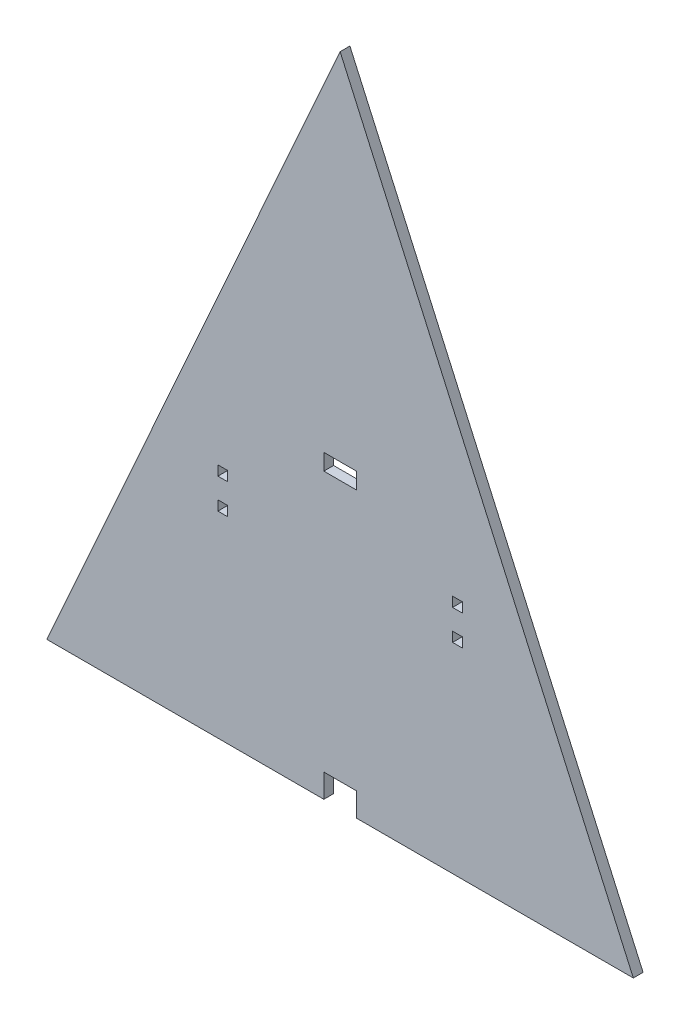
ISO-10303-21;
HEADER;
FILE_DESCRIPTION(('STEP AP214'),'2;1');
FILE_NAME('part.step','',(''),(''),'','','');
FILE_SCHEMA(('AUTOMOTIVE_DESIGN { 1 0 10303 214 1 1 1 1 }'));
ENDSEC;
DATA;
#1=APPLICATION_CONTEXT('core data for automotive mechanical design processes');
#2=APPLICATION_PROTOCOL_DEFINITION('international standard','automotive_design',2000,#1);
#3=PRODUCT_CONTEXT('',#1,'mechanical');
#4=PRODUCT('Part','Part','',(#3));
#5=PRODUCT_RELATED_PRODUCT_CATEGORY('part','',(#4));
#6=PRODUCT_DEFINITION_FORMATION('','',#4);
#7=PRODUCT_DEFINITION_CONTEXT('part definition',#1,'design');
#8=PRODUCT_DEFINITION('design','',#6,#7);
#9=PRODUCT_DEFINITION_SHAPE('','',#8);
#10=(LENGTH_UNIT() NAMED_UNIT(*) SI_UNIT(.MILLI.,.METRE.));
#11=(NAMED_UNIT(*) PLANE_ANGLE_UNIT() SI_UNIT($,.RADIAN.));
#12=(NAMED_UNIT(*) SI_UNIT($,.STERADIAN.) SOLID_ANGLE_UNIT());
#13=UNCERTAINTY_MEASURE_WITH_UNIT(LENGTH_MEASURE(1.E-05),#10,'distance_accuracy_value','');
#14=(GEOMETRIC_REPRESENTATION_CONTEXT(3) GLOBAL_UNCERTAINTY_ASSIGNED_CONTEXT((#13)) GLOBAL_UNIT_ASSIGNED_CONTEXT((#10,
#11,#12)) REPRESENTATION_CONTEXT('',''));
#15=CARTESIAN_POINT('',(0.,0.,0.));
#16=DIRECTION('',(0.,0.,1.));
#17=DIRECTION('',(1.,0.,0.));
#18=AXIS2_PLACEMENT_3D('',#15,#16,#17);
#19=CARTESIAN_POINT('',(0.,64.4674444444445,3.));
#20=DIRECTION('',(0.,1.,0.));
#21=DIRECTION('',(0.,0.,1.));
#22=AXIS2_PLACEMENT_3D('',#19,#20,#21);
#23=PLANE('',#22);
#24=DIRECTION('',(1.,0.,0.));
#25=VECTOR('',#24,1.);
#26=CARTESIAN_POINT('',(0.,64.4674444444445,0.));
#27=LINE('',#26,#25);
#28=CARTESIAN_POINT('',(124.51,64.4674444444445,0.));
#29=VERTEX_POINT('',#28);
#30=CARTESIAN_POINT('',(127.51,64.4674444444445,0.));
#31=VERTEX_POINT('',#30);
#32=EDGE_CURVE('E309',#29,#31,#27,.T.);
#33=ORIENTED_EDGE('',*,*,#32,.T.);
#34=DIRECTION('',(0.,0.,-1.));
#35=VECTOR('',#34,1.);
#36=CARTESIAN_POINT('',(127.51,64.4674444444445,3.));
#37=LINE('',#36,#35);
#38=CARTESIAN_POINT('',(127.51,64.4674444444445,3.));
#39=VERTEX_POINT('',#38);
#40=EDGE_CURVE('E11',#39,#31,#37,.T.);
#41=ORIENTED_EDGE('',*,*,#40,.F.);
#42=DIRECTION('',(1.,0.,0.));
#43=VECTOR('',#42,1.);
#44=CARTESIAN_POINT('',(0.,64.4674444444445,3.));
#45=LINE('',#44,#43);
#46=CARTESIAN_POINT('',(124.51,64.4674444444445,3.));
#47=VERTEX_POINT('',#46);
#48=EDGE_CURVE('E229',#47,#39,#45,.T.);
#49=ORIENTED_EDGE('',*,*,#48,.F.);
#50=DIRECTION('',(0.,0.,-1.));
#51=VECTOR('',#50,1.);
#52=CARTESIAN_POINT('',(124.51,64.4674444444445,3.));
#53=LINE('',#52,#51);
#54=EDGE_CURVE('E54',#47,#29,#53,.T.);
#55=ORIENTED_EDGE('',*,*,#54,.T.);
#56=EDGE_LOOP('',(#33,#41,#49,#55));
#57=FACE_BOUND('',#56,.T.);
#58=ADVANCED_FACE('F35',(#57),#23,.F.);
#59=CARTESIAN_POINT('',(127.51,0.,3.));
#60=DIRECTION('',(1.,0.,0.));
#61=DIRECTION('',(0.,0.,-1.));
#62=AXIS2_PLACEMENT_3D('',#59,#60,#61);
#63=PLANE('',#62);
#64=DIRECTION('',(0.,-1.,0.));
#65=VECTOR('',#64,1.);
#66=CARTESIAN_POINT('',(127.51,0.,0.));
#67=LINE('',#66,#65);
#68=CARTESIAN_POINT('',(127.51,61.4674444444445,0.));
#69=VERTEX_POINT('',#68);
#70=EDGE_CURVE('E235',#31,#69,#67,.T.);
#71=ORIENTED_EDGE('',*,*,#70,.T.);
#72=DIRECTION('',(0.,0.,-1.));
#73=VECTOR('',#72,1.);
#74=CARTESIAN_POINT('',(127.51,61.4674444444445,3.));
#75=LINE('',#74,#73);
#76=CARTESIAN_POINT('',(127.51,61.4674444444445,3.));
#77=VERTEX_POINT('',#76);
#78=EDGE_CURVE('E45',#77,#69,#75,.T.);
#79=ORIENTED_EDGE('',*,*,#78,.F.);
#80=DIRECTION('',(0.,-1.,0.));
#81=VECTOR('',#80,1.);
#82=CARTESIAN_POINT('',(127.51,0.,3.));
#83=LINE('',#82,#81);
#84=EDGE_CURVE('E223',#39,#77,#83,.T.);
#85=ORIENTED_EDGE('',*,*,#84,.F.);
#86=ORIENTED_EDGE('',*,*,#40,.T.);
#87=EDGE_LOOP('',(#71,#79,#85,#86));
#88=FACE_BOUND('',#87,.T.);
#89=ADVANCED_FACE('F234',(#88),#63,.F.);
#90=CARTESIAN_POINT('',(0.,61.4674444444445,3.));
#91=DIRECTION('',(0.,1.,0.));
#92=DIRECTION('',(0.,0.,1.));
#93=AXIS2_PLACEMENT_3D('',#90,#91,#92);
#94=PLANE('',#93);
#95=DIRECTION('',(1.,0.,0.));
#96=VECTOR('',#95,1.);
#97=CARTESIAN_POINT('',(0.,61.4674444444445,0.));
#98=LINE('',#97,#96);
#99=CARTESIAN_POINT('',(124.51,61.4674444444445,0.));
#100=VERTEX_POINT('',#99);
#101=EDGE_CURVE('E312',#100,#69,#98,.T.);
#102=ORIENTED_EDGE('',*,*,#101,.F.);
#103=DIRECTION('',(0.,0.,-1.));
#104=VECTOR('',#103,1.);
#105=CARTESIAN_POINT('',(124.51,61.4674444444445,3.));
#106=LINE('',#105,#104);
#107=CARTESIAN_POINT('',(124.51,61.4674444444445,3.));
#108=VERTEX_POINT('',#107);
#109=EDGE_CURVE('E137',#108,#100,#106,.T.);
#110=ORIENTED_EDGE('',*,*,#109,.F.);
#111=DIRECTION('',(1.,0.,0.));
#112=VECTOR('',#111,1.);
#113=CARTESIAN_POINT('',(0.,61.4674444444445,3.));
#114=LINE('',#113,#112);
#115=EDGE_CURVE('E228',#108,#77,#114,.T.);
#116=ORIENTED_EDGE('',*,*,#115,.T.);
#117=ORIENTED_EDGE('',*,*,#78,.T.);
#118=EDGE_LOOP('',(#102,#110,#116,#117));
#119=FACE_BOUND('',#118,.T.);
#120=ADVANCED_FACE('F239',(#119),#94,.T.);
#121=CARTESIAN_POINT('',(2.93087056681799E-13,63.3574444444447,3.));
#122=DIRECTION('',(0.,1.,0.));
#123=DIRECTION('',(-1.,0.,0.));
#124=AXIS2_PLACEMENT_3D('',#121,#122,#123);
#125=PLANE('',#124);
#126=DIRECTION('',(1.,0.,0.));
#127=VECTOR('',#126,1.);
#128=CARTESIAN_POINT('',(2.93087056681799E-13,63.3574444444447,0.));
#129=LINE('',#128,#127);
#130=CARTESIAN_POINT('',(52.49,63.3574444444445,0.));
#131=VERTEX_POINT('',#130);
#132=CARTESIAN_POINT('',(55.49,63.3574444444445,0.));
#133=VERTEX_POINT('',#132);
#134=EDGE_CURVE('E297',#131,#133,#129,.T.);
#135=ORIENTED_EDGE('',*,*,#134,.T.);
#136=DIRECTION('',(0.,0.,-1.));
#137=VECTOR('',#136,1.);
#138=CARTESIAN_POINT('',(55.49,63.3574444444445,3.));
#139=LINE('',#138,#137);
#140=CARTESIAN_POINT('',(55.49,63.3574444444445,3.));
#141=VERTEX_POINT('',#140);
#142=EDGE_CURVE('E319',#141,#133,#139,.T.);
#143=ORIENTED_EDGE('',*,*,#142,.F.);
#144=DIRECTION('',(1.,0.,0.));
#145=VECTOR('',#144,1.);
#146=CARTESIAN_POINT('',(2.93087056681799E-13,63.3574444444447,3.));
#147=LINE('',#146,#145);
#148=CARTESIAN_POINT('',(52.49,63.3574444444445,3.));
#149=VERTEX_POINT('',#148);
#150=EDGE_CURVE('E683',#149,#141,#147,.T.);
#151=ORIENTED_EDGE('',*,*,#150,.F.);
#152=DIRECTION('',(0.,0.,-1.));
#153=VECTOR('',#152,1.);
#154=CARTESIAN_POINT('',(52.49,63.3574444444445,3.));
#155=LINE('',#154,#153);
#156=EDGE_CURVE('E321',#149,#131,#155,.T.);
#157=ORIENTED_EDGE('',*,*,#156,.T.);
#158=EDGE_LOOP('',(#135,#143,#151,#157));
#159=FACE_BOUND('',#158,.T.);
#160=ADVANCED_FACE('F415',(#159),#125,.F.);
#161=CARTESIAN_POINT('',(55.4899999999998,-1.28346407575937E-13,3.));
#162=DIRECTION('',(1.,0.,0.));
#163=DIRECTION('',(0.,1.,0.));
#164=AXIS2_PLACEMENT_3D('',#161,#162,#163);
#165=PLANE('',#164);
#166=DIRECTION('',(0.,-1.,0.));
#167=VECTOR('',#166,1.);
#168=CARTESIAN_POINT('',(55.4899999999998,-1.28346407575937E-13,0.));
#169=LINE('',#168,#167);
#170=CARTESIAN_POINT('',(55.49,60.3574444444445,0.));
#171=VERTEX_POINT('',#170);
#172=EDGE_CURVE('E300',#133,#171,#169,.T.);
#173=ORIENTED_EDGE('',*,*,#172,.T.);
#174=DIRECTION('',(0.,0.,-1.));
#175=VECTOR('',#174,1.);
#176=CARTESIAN_POINT('',(55.49,60.3574444444445,3.));
#177=LINE('',#176,#175);
#178=CARTESIAN_POINT('',(55.49,60.3574444444445,3.));
#179=VERTEX_POINT('',#178);
#180=EDGE_CURVE('E326',#179,#171,#177,.T.);
#181=ORIENTED_EDGE('',*,*,#180,.F.);
#182=DIRECTION('',(0.,-1.,0.));
#183=VECTOR('',#182,1.);
#184=CARTESIAN_POINT('',(55.4899999999998,-1.28346407575937E-13,3.));
#185=LINE('',#184,#183);
#186=EDGE_CURVE('E734',#141,#179,#185,.T.);
#187=ORIENTED_EDGE('',*,*,#186,.F.);
#188=ORIENTED_EDGE('',*,*,#142,.T.);
#189=EDGE_LOOP('',(#173,#181,#187,#188));
#190=FACE_BOUND('',#189,.T.);
#191=ADVANCED_FACE('F411',(#190),#165,.F.);
#192=CARTESIAN_POINT('',(0.,60.3574444444445,3.));
#193=DIRECTION('',(0.,1.,0.));
#194=DIRECTION('',(0.,0.,1.));
#195=AXIS2_PLACEMENT_3D('',#192,#193,#194);
#196=PLANE('',#195);
#197=DIRECTION('',(1.,0.,0.));
#198=VECTOR('',#197,1.);
#199=CARTESIAN_POINT('',(0.,60.3574444444445,0.));
#200=LINE('',#199,#198);
#201=CARTESIAN_POINT('',(52.49,60.3574444444445,0.));
#202=VERTEX_POINT('',#201);
#203=EDGE_CURVE('E303',#202,#171,#200,.T.);
#204=ORIENTED_EDGE('',*,*,#203,.F.);
#205=DIRECTION('',(0.,0.,-1.));
#206=VECTOR('',#205,1.);
#207=CARTESIAN_POINT('',(52.49,60.3574444444445,3.));
#208=LINE('',#207,#206);
#209=CARTESIAN_POINT('',(52.49,60.3574444444445,3.));
#210=VERTEX_POINT('',#209);
#211=EDGE_CURVE('E323',#210,#202,#208,.T.);
#212=ORIENTED_EDGE('',*,*,#211,.F.);
#213=DIRECTION('',(1.,0.,0.));
#214=VECTOR('',#213,1.);
#215=CARTESIAN_POINT('',(0.,60.3574444444445,3.));
#216=LINE('',#215,#214);
#217=EDGE_CURVE('E741',#210,#179,#216,.T.);
#218=ORIENTED_EDGE('',*,*,#217,.T.);
#219=ORIENTED_EDGE('',*,*,#180,.T.);
#220=EDGE_LOOP('',(#204,#212,#218,#219));
#221=FACE_BOUND('',#220,.T.);
#222=ADVANCED_FACE('F407',(#221),#196,.T.);
#223=CARTESIAN_POINT('',(0.,7.26000000000002,3.));
#224=DIRECTION('',(0.,1.,0.));
#225=DIRECTION('',(0.,0.,1.));
#226=AXIS2_PLACEMENT_3D('',#223,#224,#225);
#227=PLANE('',#226);
#228=DIRECTION('',(1.,0.,0.));
#229=VECTOR('',#228,1.);
#230=CARTESIAN_POINT('',(0.,7.26000000000002,0.));
#231=LINE('',#230,#229);
#232=CARTESIAN_POINT('',(85.,7.26000000000002,0.));
#233=VERTEX_POINT('',#232);
#234=CARTESIAN_POINT('',(94.9999999999997,7.26000000000002,0.));
#235=VERTEX_POINT('',#234);
#236=EDGE_CURVE('E282',#233,#235,#231,.T.);
#237=ORIENTED_EDGE('',*,*,#236,.T.);
#238=DIRECTION('',(0.,0.,-1.));
#239=VECTOR('',#238,1.);
#240=CARTESIAN_POINT('',(94.9999999999997,7.26000000000002,3.));
#241=LINE('',#240,#239);
#242=CARTESIAN_POINT('',(94.9999999999997,7.26000000000002,3.));
#243=VERTEX_POINT('',#242);
#244=EDGE_CURVE('E324',#243,#235,#241,.T.);
#245=ORIENTED_EDGE('',*,*,#244,.F.);
#246=DIRECTION('',(1.,0.,0.));
#247=VECTOR('',#246,1.);
#248=CARTESIAN_POINT('',(0.,7.26000000000002,3.));
#249=LINE('',#248,#247);
#250=CARTESIAN_POINT('',(85.,7.26000000000002,3.));
#251=VERTEX_POINT('',#250);
#252=EDGE_CURVE('E689',#251,#243,#249,.T.);
#253=ORIENTED_EDGE('',*,*,#252,.F.);
#254=DIRECTION('',(0.,0.,-1.));
#255=VECTOR('',#254,1.);
#256=CARTESIAN_POINT('',(85.,7.26000000000002,3.));
#257=LINE('',#256,#255);
#258=EDGE_CURVE('E330',#251,#233,#257,.T.);
#259=ORIENTED_EDGE('',*,*,#258,.T.);
#260=EDGE_LOOP('',(#237,#245,#253,#259));
#261=FACE_BOUND('',#260,.T.);
#262=ADVANCED_FACE('F410',(#261),#227,.F.);
#263=CARTESIAN_POINT('',(94.9999999999997,0.,3.));
#264=DIRECTION('',(1.,0.,0.));
#265=DIRECTION('',(0.,0.,-1.));
#266=AXIS2_PLACEMENT_3D('',#263,#264,#265);
#267=PLANE('',#266);
#268=DIRECTION('',(0.,-1.,0.));
#269=VECTOR('',#268,1.);
#270=CARTESIAN_POINT('',(94.9999999999997,0.,0.));
#271=LINE('',#270,#269);
#272=CARTESIAN_POINT('',(94.9999999999997,0.,0.));
#273=VERTEX_POINT('',#272);
#274=EDGE_CURVE('E285',#235,#273,#271,.T.);
#275=ORIENTED_EDGE('',*,*,#274,.T.);
#276=DIRECTION('',(0.,0.,-1.));
#277=VECTOR('',#276,1.);
#278=CARTESIAN_POINT('',(94.9999999999997,0.,3.));
#279=LINE('',#278,#277);
#280=CARTESIAN_POINT('',(94.9999999999997,0.,3.));
#281=VERTEX_POINT('',#280);
#282=EDGE_CURVE('E344',#281,#273,#279,.T.);
#283=ORIENTED_EDGE('',*,*,#282,.F.);
#284=DIRECTION('',(0.,-1.,0.));
#285=VECTOR('',#284,1.);
#286=CARTESIAN_POINT('',(94.9999999999997,0.,3.));
#287=LINE('',#286,#285);
#288=EDGE_CURVE('E688',#243,#281,#287,.T.);
#289=ORIENTED_EDGE('',*,*,#288,.F.);
#290=ORIENTED_EDGE('',*,*,#244,.T.);
#291=EDGE_LOOP('',(#275,#283,#289,#290));
#292=FACE_BOUND('',#291,.T.);
#293=ADVANCED_FACE('F438',(#292),#267,.F.);
#294=CARTESIAN_POINT('',(0.,0.,3.));
#295=DIRECTION('',(0.,1.,0.));
#296=DIRECTION('',(0.,0.,1.));
#297=AXIS2_PLACEMENT_3D('',#294,#295,#296);
#298=PLANE('',#297);
#299=DIRECTION('',(1.,0.,0.));
#300=VECTOR('',#299,1.);
#301=CARTESIAN_POINT('',(0.,0.,0.));
#302=LINE('',#301,#300);
#303=CARTESIAN_POINT('',(180.,0.,0.));
#304=VERTEX_POINT('',#303);
#305=EDGE_CURVE('E287',#273,#304,#302,.T.);
#306=ORIENTED_EDGE('',*,*,#305,.T.);
#307=DIRECTION('',(0.,0.,-1.));
#308=VECTOR('',#307,1.);
#309=CARTESIAN_POINT('',(180.,0.,3.));
#310=LINE('',#309,#308);
#311=CARTESIAN_POINT('',(180.,0.,3.));
#312=VERTEX_POINT('',#311);
#313=EDGE_CURVE('E341',#312,#304,#310,.T.);
#314=ORIENTED_EDGE('',*,*,#313,.F.);
#315=DIRECTION('',(1.,0.,0.));
#316=VECTOR('',#315,1.);
#317=CARTESIAN_POINT('',(0.,0.,3.));
#318=LINE('',#317,#316);
#319=EDGE_CURVE('E682',#281,#312,#318,.T.);
#320=ORIENTED_EDGE('',*,*,#319,.F.);
#321=ORIENTED_EDGE('',*,*,#282,.T.);
#322=EDGE_LOOP('',(#306,#314,#320,#321));
#323=FACE_BOUND('',#322,.T.);
#324=ADVANCED_FACE('F430',(#323),#298,.F.);
#325=CARTESIAN_POINT('',(150.000964475165,67.081176659701,3.));
#326=DIRECTION('',(-0.912873863975025,-0.408241727988831,0.));
#327=DIRECTION('',(0.408241727988831,-0.912873863975025,0.));
#328=AXIS2_PLACEMENT_3D('',#325,#326,#327);
#329=PLANE('',#328);
#330=DIRECTION('',(-0.408241727988831,0.912873863975025,0.));
#331=VECTOR('',#330,1.);
#332=CARTESIAN_POINT('',(150.000964475165,67.081176659701,0.));
#333=LINE('',#332,#331);
#334=CARTESIAN_POINT('',(90.,201.25,0.));
#335=VERTEX_POINT('',#334);
#336=EDGE_CURVE('E289',#304,#335,#333,.T.);
#337=ORIENTED_EDGE('',*,*,#336,.T.);
#338=DIRECTION('',(0.,0.,-1.));
#339=VECTOR('',#338,1.);
#340=CARTESIAN_POINT('',(90.,201.25,3.));
#341=LINE('',#340,#339);
#342=CARTESIAN_POINT('',(90.,201.25,3.));
#343=VERTEX_POINT('',#342);
#344=EDGE_CURVE('E338',#343,#335,#341,.T.);
#345=ORIENTED_EDGE('',*,*,#344,.F.);
#346=DIRECTION('',(-0.408241727988831,0.912873863975025,0.));
#347=VECTOR('',#346,1.);
#348=CARTESIAN_POINT('',(150.000964475165,67.081176659701,3.));
#349=LINE('',#348,#347);
#350=EDGE_CURVE('E665',#312,#343,#349,.T.);
#351=ORIENTED_EDGE('',*,*,#350,.F.);
#352=ORIENTED_EDGE('',*,*,#313,.T.);
#353=EDGE_LOOP('',(#337,#345,#351,#352));
#354=FACE_BOUND('',#353,.T.);
#355=ADVANCED_FACE('F433',(#354),#329,.F.);
#356=CARTESIAN_POINT('',(0.,0.,3.));
#357=DIRECTION('',(0.912873863975025,-0.408241727988831,0.));
#358=DIRECTION('',(0.408241727988831,0.912873863975026,0.));
#359=AXIS2_PLACEMENT_3D('',#356,#357,#358);
#360=PLANE('',#359);
#361=DIRECTION('',(-0.408241727988831,-0.912873863975025,0.));
#362=VECTOR('',#361,1.);
#363=CARTESIAN_POINT('',(0.,0.,0.));
#364=LINE('',#363,#362);
#365=CARTESIAN_POINT('',(0.,0.,0.));
#366=VERTEX_POINT('',#365);
#367=EDGE_CURVE('E292',#335,#366,#364,.T.);
#368=ORIENTED_EDGE('',*,*,#367,.T.);
#369=DIRECTION('',(0.,0.,-1.));
#370=VECTOR('',#369,1.);
#371=CARTESIAN_POINT('',(0.,0.,3.));
#372=LINE('',#371,#370);
#373=CARTESIAN_POINT('',(0.,0.,3.));
#374=VERTEX_POINT('',#373);
#375=EDGE_CURVE('E335',#374,#366,#372,.T.);
#376=ORIENTED_EDGE('',*,*,#375,.F.);
#377=DIRECTION('',(-0.408241727988831,-0.912873863975025,0.));
#378=VECTOR('',#377,1.);
#379=CARTESIAN_POINT('',(0.,0.,3.));
#380=LINE('',#379,#378);
#381=EDGE_CURVE('E680',#343,#374,#380,.T.);
#382=ORIENTED_EDGE('',*,*,#381,.F.);
#383=ORIENTED_EDGE('',*,*,#344,.T.);
#384=EDGE_LOOP('',(#368,#376,#382,#383));
#385=FACE_BOUND('',#384,.T.);
#386=ADVANCED_FACE('F428',(#385),#360,.F.);
#387=CARTESIAN_POINT('',(85.,0.,0.));
#388=VERTEX_POINT('',#387);
#389=EDGE_CURVE('E290',#366,#388,#302,.T.);
#390=ORIENTED_EDGE('',*,*,#389,.T.);
#391=DIRECTION('',(0.,0.,-1.));
#392=VECTOR('',#391,1.);
#393=CARTESIAN_POINT('',(85.,0.,3.));
#394=LINE('',#393,#392);
#395=CARTESIAN_POINT('',(85.,0.,3.));
#396=VERTEX_POINT('',#395);
#397=EDGE_CURVE('E332',#396,#388,#394,.T.);
#398=ORIENTED_EDGE('',*,*,#397,.F.);
#399=EDGE_CURVE('E675',#374,#396,#318,.T.);
#400=ORIENTED_EDGE('',*,*,#399,.F.);
#401=ORIENTED_EDGE('',*,*,#375,.T.);
#402=EDGE_LOOP('',(#390,#398,#400,#401));
#403=FACE_BOUND('',#402,.T.);
#404=ADVANCED_FACE('F424',(#403),#298,.F.);
#405=CARTESIAN_POINT('',(85.,0.,3.));
#406=DIRECTION('',(1.,0.,0.));
#407=DIRECTION('',(0.,0.,-1.));
#408=AXIS2_PLACEMENT_3D('',#405,#406,#407);
#409=PLANE('',#408);
#410=DIRECTION('',(0.,-1.,0.));
#411=VECTOR('',#410,1.);
#412=CARTESIAN_POINT('',(85.,0.,0.));
#413=LINE('',#412,#411);
#414=CARTESIAN_POINT('',(85.,92.2374444444445,0.));
#415=VERTEX_POINT('',#414);
#416=CARTESIAN_POINT('',(85.,87.2374444444444,0.));
#417=VERTEX_POINT('',#416);
#418=EDGE_CURVE('E270',#415,#417,#413,.T.);
#419=ORIENTED_EDGE('',*,*,#418,.F.);
#420=DIRECTION('',(0.,0.,-1.));
#421=VECTOR('',#420,1.);
#422=CARTESIAN_POINT('',(85.,92.2374444444445,3.));
#423=LINE('',#422,#421);
#424=CARTESIAN_POINT('',(85.,92.2374444444445,3.));
#425=VERTEX_POINT('',#424);
#426=EDGE_CURVE('E333',#425,#415,#423,.T.);
#427=ORIENTED_EDGE('',*,*,#426,.F.);
#428=DIRECTION('',(0.,-1.,0.));
#429=VECTOR('',#428,1.);
#430=CARTESIAN_POINT('',(85.,0.,3.));
#431=LINE('',#430,#429);
#432=CARTESIAN_POINT('',(85.,87.2374444444444,3.));
#433=VERTEX_POINT('',#432);
#434=EDGE_CURVE('E701',#425,#433,#431,.T.);
#435=ORIENTED_EDGE('',*,*,#434,.T.);
#436=DIRECTION('',(0.,0.,-1.));
#437=VECTOR('',#436,1.);
#438=CARTESIAN_POINT('',(85.,87.2374444444444,3.));
#439=LINE('',#438,#437);
#440=EDGE_CURVE('E349',#433,#417,#439,.T.);
#441=ORIENTED_EDGE('',*,*,#440,.T.);
#442=EDGE_LOOP('',(#419,#427,#435,#441));
#443=FACE_BOUND('',#442,.T.);
#444=ADVANCED_FACE('F427',(#443),#409,.T.);
#445=CARTESIAN_POINT('',(0.,92.2374444444445,3.));
#446=DIRECTION('',(0.,-1.,0.));
#447=DIRECTION('',(0.,0.,-1.));
#448=AXIS2_PLACEMENT_3D('',#445,#446,#447);
#449=PLANE('',#448);
#450=DIRECTION('',(-1.,0.,0.));
#451=VECTOR('',#450,1.);
#452=CARTESIAN_POINT('',(0.,92.2374444444445,0.));
#453=LINE('',#452,#451);
#454=CARTESIAN_POINT('',(94.9999999999997,92.2374444444445,0.));
#455=VERTEX_POINT('',#454);
#456=EDGE_CURVE('E273',#455,#415,#453,.T.);
#457=ORIENTED_EDGE('',*,*,#456,.F.);
#458=DIRECTION('',(0.,0.,-1.));
#459=VECTOR('',#458,1.);
#460=CARTESIAN_POINT('',(94.9999999999997,92.2374444444445,3.));
#461=LINE('',#460,#459);
#462=CARTESIAN_POINT('',(94.9999999999997,92.2374444444445,3.));
#463=VERTEX_POINT('',#462);
#464=EDGE_CURVE('E355',#463,#455,#461,.T.);
#465=ORIENTED_EDGE('',*,*,#464,.F.);
#466=DIRECTION('',(-1.,0.,0.));
#467=VECTOR('',#466,1.);
#468=CARTESIAN_POINT('',(0.,92.2374444444445,3.));
#469=LINE('',#468,#467);
#470=EDGE_CURVE('E698',#463,#425,#469,.T.);
#471=ORIENTED_EDGE('',*,*,#470,.T.);
#472=ORIENTED_EDGE('',*,*,#426,.T.);
#473=EDGE_LOOP('',(#457,#465,#471,#472));
#474=FACE_BOUND('',#473,.T.);
#475=ADVANCED_FACE('F453',(#474),#449,.T.);
#476=CARTESIAN_POINT('',(94.9999999999997,0.,3.));
#477=DIRECTION('',(1.,0.,0.));
#478=DIRECTION('',(0.,0.,-1.));
#479=AXIS2_PLACEMENT_3D('',#476,#477,#478);
#480=PLANE('',#479);
#481=DIRECTION('',(0.,-1.,0.));
#482=VECTOR('',#481,1.);
#483=CARTESIAN_POINT('',(94.9999999999997,0.,0.));
#484=LINE('',#483,#482);
#485=CARTESIAN_POINT('',(94.9999999999997,87.2374444444447,0.));
#486=VERTEX_POINT('',#485);
#487=EDGE_CURVE('E276',#455,#486,#484,.T.);
#488=ORIENTED_EDGE('',*,*,#487,.T.);
#489=DIRECTION('',(0.,0.,-1.));
#490=VECTOR('',#489,1.);
#491=CARTESIAN_POINT('',(94.9999999999997,87.2374444444447,3.));
#492=LINE('',#491,#490);
#493=CARTESIAN_POINT('',(94.9999999999997,87.2374444444447,3.));
#494=VERTEX_POINT('',#493);
#495=EDGE_CURVE('E351',#494,#486,#492,.T.);
#496=ORIENTED_EDGE('',*,*,#495,.F.);
#497=DIRECTION('',(0.,-1.,0.));
#498=VECTOR('',#497,1.);
#499=CARTESIAN_POINT('',(94.9999999999997,0.,3.));
#500=LINE('',#499,#498);
#501=EDGE_CURVE('E695',#463,#494,#500,.T.);
#502=ORIENTED_EDGE('',*,*,#501,.F.);
#503=ORIENTED_EDGE('',*,*,#464,.T.);
#504=EDGE_LOOP('',(#488,#496,#502,#503));
#505=FACE_BOUND('',#504,.T.);
#506=ADVANCED_FACE('F449',(#505),#480,.F.);
#507=CARTESIAN_POINT('',(0.,72.6574444444445,3.));
#508=DIRECTION('',(0.,1.,0.));
#509=DIRECTION('',(0.,0.,1.));
#510=AXIS2_PLACEMENT_3D('',#507,#508,#509);
#511=PLANE('',#510);
#512=DIRECTION('',(1.,0.,0.));
#513=VECTOR('',#512,1.);
#514=CARTESIAN_POINT('',(0.,72.6574444444445,0.));
#515=LINE('',#514,#513);
#516=CARTESIAN_POINT('',(52.49,72.6574444444445,0.));
#517=VERTEX_POINT('',#516);
#518=CARTESIAN_POINT('',(55.49,72.6574444444445,0.));
#519=VERTEX_POINT('',#518);
#520=EDGE_CURVE('E258',#517,#519,#515,.T.);
#521=ORIENTED_EDGE('',*,*,#520,.T.);
#522=DIRECTION('',(0.,0.,-1.));
#523=VECTOR('',#522,1.);
#524=CARTESIAN_POINT('',(55.49,72.6574444444445,3.));
#525=LINE('',#524,#523);
#526=CARTESIAN_POINT('',(55.49,72.6574444444445,3.));
#527=VERTEX_POINT('',#526);
#528=EDGE_CURVE('E352',#527,#519,#525,.T.);
#529=ORIENTED_EDGE('',*,*,#528,.F.);
#530=DIRECTION('',(1.,0.,0.));
#531=VECTOR('',#530,1.);
#532=CARTESIAN_POINT('',(0.,72.6574444444445,3.));
#533=LINE('',#532,#531);
#534=CARTESIAN_POINT('',(52.49,72.6574444444445,3.));
#535=VERTEX_POINT('',#534);
#536=EDGE_CURVE('E712',#535,#527,#533,.T.);
#537=ORIENTED_EDGE('',*,*,#536,.F.);
#538=DIRECTION('',(0.,0.,-1.));
#539=VECTOR('',#538,1.);
#540=CARTESIAN_POINT('',(52.49,72.6574444444445,3.));
#541=LINE('',#540,#539);
#542=EDGE_CURVE('E358',#535,#517,#541,.T.);
#543=ORIENTED_EDGE('',*,*,#542,.T.);
#544=EDGE_LOOP('',(#521,#529,#537,#543));
#545=FACE_BOUND('',#544,.T.);
#546=ADVANCED_FACE('F452',(#545),#511,.F.);
#547=CARTESIAN_POINT('',(55.4900000000001,1.28346407575938E-13,3.));
#548=DIRECTION('',(1.,0.,0.));
#549=DIRECTION('',(0.,1.,0.));
#550=AXIS2_PLACEMENT_3D('',#547,#548,#549);
#551=PLANE('',#550);
#552=DIRECTION('',(0.,-1.,0.));
#553=VECTOR('',#552,1.);
#554=CARTESIAN_POINT('',(55.4900000000001,1.28346407575938E-13,0.));
#555=LINE('',#554,#553);
#556=CARTESIAN_POINT('',(55.49,69.6574444444445,0.));
#557=VERTEX_POINT('',#556);
#558=EDGE_CURVE('E261',#519,#557,#555,.T.);
#559=ORIENTED_EDGE('',*,*,#558,.T.);
#560=DIRECTION('',(0.,0.,-1.));
#561=VECTOR('',#560,1.);
#562=CARTESIAN_POINT('',(55.49,69.6574444444445,3.));
#563=LINE('',#562,#561);
#564=CARTESIAN_POINT('',(55.49,69.6574444444445,3.));
#565=VERTEX_POINT('',#564);
#566=EDGE_CURVE('E362',#565,#557,#563,.T.);
#567=ORIENTED_EDGE('',*,*,#566,.F.);
#568=DIRECTION('',(0.,-1.,0.));
#569=VECTOR('',#568,1.);
#570=CARTESIAN_POINT('',(55.4900000000001,1.28346407575938E-13,3.));
#571=LINE('',#570,#569);
#572=EDGE_CURVE('E710',#527,#565,#571,.T.);
#573=ORIENTED_EDGE('',*,*,#572,.F.);
#574=ORIENTED_EDGE('',*,*,#528,.T.);
#575=EDGE_LOOP('',(#559,#567,#573,#574));
#576=FACE_BOUND('',#575,.T.);
#577=ADVANCED_FACE('F467',(#576),#551,.F.);
#578=CARTESIAN_POINT('',(0.,69.6574444444445,3.));
#579=DIRECTION('',(0.,1.,0.));
#580=DIRECTION('',(0.,0.,1.));
#581=AXIS2_PLACEMENT_3D('',#578,#579,#580);
#582=PLANE('',#581);
#583=DIRECTION('',(1.,0.,0.));
#584=VECTOR('',#583,1.);
#585=CARTESIAN_POINT('',(0.,69.6574444444445,0.));
#586=LINE('',#585,#584);
#587=CARTESIAN_POINT('',(52.49,69.6574444444445,0.));
#588=VERTEX_POINT('',#587);
#589=EDGE_CURVE('E264',#588,#557,#586,.T.);
#590=ORIENTED_EDGE('',*,*,#589,.F.);
#591=DIRECTION('',(0.,0.,-1.));
#592=VECTOR('',#591,1.);
#593=CARTESIAN_POINT('',(52.49,69.6574444444445,3.));
#594=LINE('',#593,#592);
#595=CARTESIAN_POINT('',(52.49,69.6574444444445,3.));
#596=VERTEX_POINT('',#595);
#597=EDGE_CURVE('E360',#596,#588,#594,.T.);
#598=ORIENTED_EDGE('',*,*,#597,.F.);
#599=DIRECTION('',(1.,0.,0.));
#600=VECTOR('',#599,1.);
#601=CARTESIAN_POINT('',(0.,69.6574444444445,3.));
#602=LINE('',#601,#600);
#603=EDGE_CURVE('E707',#596,#565,#602,.T.);
#604=ORIENTED_EDGE('',*,*,#603,.T.);
#605=ORIENTED_EDGE('',*,*,#566,.T.);
#606=EDGE_LOOP('',(#590,#598,#604,#605));
#607=FACE_BOUND('',#606,.T.);
#608=ADVANCED_FACE('F464',(#607),#582,.T.);
#609=CARTESIAN_POINT('',(0.,73.7674444444445,3.));
#610=DIRECTION('',(0.,1.,0.));
#611=DIRECTION('',(0.,0.,1.));
#612=AXIS2_PLACEMENT_3D('',#609,#610,#611);
#613=PLANE('',#612);
#614=DIRECTION('',(1.,0.,0.));
#615=VECTOR('',#614,1.);
#616=CARTESIAN_POINT('',(0.,73.7674444444445,0.));
#617=LINE('',#616,#615);
#618=CARTESIAN_POINT('',(124.51,73.7674444444445,0.));
#619=VERTEX_POINT('',#618);
#620=CARTESIAN_POINT('',(127.51,73.7674444444445,0.));
#621=VERTEX_POINT('',#620);
#622=EDGE_CURVE('E246',#619,#621,#617,.T.);
#623=ORIENTED_EDGE('',*,*,#622,.T.);
#624=DIRECTION('',(0.,0.,-1.));
#625=VECTOR('',#624,1.);
#626=CARTESIAN_POINT('',(127.51,73.7674444444445,3.));
#627=LINE('',#626,#625);
#628=CARTESIAN_POINT('',(127.51,73.7674444444445,3.));
#629=VERTEX_POINT('',#628);
#630=EDGE_CURVE('E39',#629,#621,#627,.T.);
#631=ORIENTED_EDGE('',*,*,#630,.F.);
#632=DIRECTION('',(1.,0.,0.));
#633=VECTOR('',#632,1.);
#634=CARTESIAN_POINT('',(0.,73.7674444444445,3.));
#635=LINE('',#634,#633);
#636=CARTESIAN_POINT('',(124.51,73.7674444444445,3.));
#637=VERTEX_POINT('',#636);
#638=EDGE_CURVE('E317',#637,#629,#635,.T.);
#639=ORIENTED_EDGE('',*,*,#638,.F.);
#640=DIRECTION('',(0.,0.,-1.));
#641=VECTOR('',#640,1.);
#642=CARTESIAN_POINT('',(124.51,73.7674444444445,3.));
#643=LINE('',#642,#641);
#644=EDGE_CURVE('E242',#637,#619,#643,.T.);
#645=ORIENTED_EDGE('',*,*,#644,.T.);
#646=EDGE_LOOP('',(#623,#631,#639,#645));
#647=FACE_BOUND('',#646,.T.);
#648=ADVANCED_FACE('F37',(#647),#613,.F.);
#649=CARTESIAN_POINT('',(127.51,0.,3.));
#650=DIRECTION('',(1.,0.,0.));
#651=DIRECTION('',(0.,0.,-1.));
#652=AXIS2_PLACEMENT_3D('',#649,#650,#651);
#653=PLANE('',#652);
#654=DIRECTION('',(0.,-1.,0.));
#655=VECTOR('',#654,1.);
#656=CARTESIAN_POINT('',(127.51,0.,0.));
#657=LINE('',#656,#655);
#658=CARTESIAN_POINT('',(127.51,70.7674444444445,0.));
#659=VERTEX_POINT('',#658);
#660=EDGE_CURVE('E249',#621,#659,#657,.T.);
#661=ORIENTED_EDGE('',*,*,#660,.T.);
#662=DIRECTION('',(0.,0.,-1.));
#663=VECTOR('',#662,1.);
#664=CARTESIAN_POINT('',(127.51,70.7674444444445,3.));
#665=LINE('',#664,#663);
#666=CARTESIAN_POINT('',(127.51,70.7674444444445,3.));
#667=VERTEX_POINT('',#666);
#668=EDGE_CURVE('E368',#667,#659,#665,.T.);
#669=ORIENTED_EDGE('',*,*,#668,.F.);
#670=DIRECTION('',(0.,-1.,0.));
#671=VECTOR('',#670,1.);
#672=CARTESIAN_POINT('',(127.51,0.,3.));
#673=LINE('',#672,#671);
#674=EDGE_CURVE('E150',#629,#667,#673,.T.);
#675=ORIENTED_EDGE('',*,*,#674,.F.);
#676=ORIENTED_EDGE('',*,*,#630,.T.);
#677=EDGE_LOOP('',(#661,#669,#675,#676));
#678=FACE_BOUND('',#677,.T.);
#679=ADVANCED_FACE('F373',(#678),#653,.F.);
#680=CARTESIAN_POINT('',(0.,70.7674444444445,3.));
#681=DIRECTION('',(0.,1.,0.));
#682=DIRECTION('',(0.,0.,1.));
#683=AXIS2_PLACEMENT_3D('',#680,#681,#682);
#684=PLANE('',#683);
#685=DIRECTION('',(1.,0.,0.));
#686=VECTOR('',#685,1.);
#687=CARTESIAN_POINT('',(0.,70.7674444444445,0.));
#688=LINE('',#687,#686);
#689=CARTESIAN_POINT('',(124.51,70.7674444444445,0.));
#690=VERTEX_POINT('',#689);
#691=EDGE_CURVE('E252',#690,#659,#688,.T.);
#692=ORIENTED_EDGE('',*,*,#691,.F.);
#693=DIRECTION('',(0.,0.,-1.));
#694=VECTOR('',#693,1.);
#695=CARTESIAN_POINT('',(124.51,70.7674444444445,3.));
#696=LINE('',#695,#694);
#697=CARTESIAN_POINT('',(124.51,70.7674444444445,3.));
#698=VERTEX_POINT('',#697);
#699=EDGE_CURVE('E367',#698,#690,#696,.T.);
#700=ORIENTED_EDGE('',*,*,#699,.F.);
#701=DIRECTION('',(1.,0.,0.));
#702=VECTOR('',#701,1.);
#703=CARTESIAN_POINT('',(0.,70.7674444444445,3.));
#704=LINE('',#703,#702);
#705=EDGE_CURVE('E716',#698,#667,#704,.T.);
#706=ORIENTED_EDGE('',*,*,#705,.T.);
#707=ORIENTED_EDGE('',*,*,#668,.T.);
#708=EDGE_LOOP('',(#692,#700,#706,#707));
#709=FACE_BOUND('',#708,.T.);
#710=ADVANCED_FACE('F387',(#709),#684,.T.);
#711=CARTESIAN_POINT('',(52.49,0.,3.));
#712=DIRECTION('',(1.,0.,0.));
#713=DIRECTION('',(0.,0.,-1.));
#714=AXIS2_PLACEMENT_3D('',#711,#712,#713);
#715=PLANE('',#714);
#716=DIRECTION('',(0.,-1.,0.));
#717=VECTOR('',#716,1.);
#718=CARTESIAN_POINT('',(52.49,0.,0.));
#719=LINE('',#718,#717);
#720=EDGE_CURVE('E306',#131,#202,#719,.T.);
#721=ORIENTED_EDGE('',*,*,#720,.F.);
#722=ORIENTED_EDGE('',*,*,#156,.F.);
#723=DIRECTION('',(0.,-1.,0.));
#724=VECTOR('',#723,1.);
#725=CARTESIAN_POINT('',(52.49,0.,3.));
#726=LINE('',#725,#724);
#727=EDGE_CURVE('E737',#149,#210,#726,.T.);
#728=ORIENTED_EDGE('',*,*,#727,.T.);
#729=ORIENTED_EDGE('',*,*,#211,.T.);
#730=EDGE_LOOP('',(#721,#722,#728,#729));
#731=FACE_BOUND('',#730,.T.);
#732=ADVANCED_FACE('F389',(#731),#715,.T.);
#733=CARTESIAN_POINT('',(85.,4.87442960191829E-13,3.));
#734=DIRECTION('',(1.,0.,0.));
#735=DIRECTION('',(0.,1.,0.));
#736=AXIS2_PLACEMENT_3D('',#733,#734,#735);
#737=PLANE('',#736);
#738=DIRECTION('',(0.,-1.,0.));
#739=VECTOR('',#738,1.);
#740=CARTESIAN_POINT('',(85.,4.87442960191829E-13,0.));
#741=LINE('',#740,#739);
#742=EDGE_CURVE('E294',#233,#388,#741,.T.);
#743=ORIENTED_EDGE('',*,*,#742,.F.);
#744=ORIENTED_EDGE('',*,*,#258,.F.);
#745=DIRECTION('',(0.,-1.,0.));
#746=VECTOR('',#745,1.);
#747=CARTESIAN_POINT('',(85.,4.87442960191829E-13,3.));
#748=LINE('',#747,#746);
#749=EDGE_CURVE('E679',#251,#396,#748,.T.);
#750=ORIENTED_EDGE('',*,*,#749,.T.);
#751=ORIENTED_EDGE('',*,*,#397,.T.);
#752=EDGE_LOOP('',(#743,#744,#750,#751));
#753=FACE_BOUND('',#752,.T.);
#754=ADVANCED_FACE('F395',(#753),#737,.T.);
#755=CARTESIAN_POINT('',(-2.0581266629232E-12,87.2374444444424,3.));
#756=DIRECTION('',(0.,-1.,0.));
#757=DIRECTION('',(1.,0.,0.));
#758=AXIS2_PLACEMENT_3D('',#755,#756,#757);
#759=PLANE('',#758);
#760=DIRECTION('',(-1.,0.,0.));
#761=VECTOR('',#760,1.);
#762=CARTESIAN_POINT('',(-2.0581266629232E-12,87.2374444444424,0.));
#763=LINE('',#762,#761);
#764=EDGE_CURVE('E279',#486,#417,#763,.T.);
#765=ORIENTED_EDGE('',*,*,#764,.T.);
#766=ORIENTED_EDGE('',*,*,#440,.F.);
#767=DIRECTION('',(-1.,0.,0.));
#768=VECTOR('',#767,1.);
#769=CARTESIAN_POINT('',(-2.0581266629232E-12,87.2374444444424,3.));
#770=LINE('',#769,#768);
#771=EDGE_CURVE('E691',#494,#433,#770,.T.);
#772=ORIENTED_EDGE('',*,*,#771,.F.);
#773=ORIENTED_EDGE('',*,*,#495,.T.);
#774=EDGE_LOOP('',(#765,#766,#772,#773));
#775=FACE_BOUND('',#774,.T.);
#776=ADVANCED_FACE('F422',(#775),#759,.F.);
#777=CARTESIAN_POINT('',(52.49,0.,3.));
#778=DIRECTION('',(1.,0.,0.));
#779=DIRECTION('',(0.,0.,-1.));
#780=AXIS2_PLACEMENT_3D('',#777,#778,#779);
#781=PLANE('',#780);
#782=DIRECTION('',(0.,-1.,0.));
#783=VECTOR('',#782,1.);
#784=CARTESIAN_POINT('',(52.49,0.,0.));
#785=LINE('',#784,#783);
#786=EDGE_CURVE('E267',#517,#588,#785,.T.);
#787=ORIENTED_EDGE('',*,*,#786,.F.);
#788=ORIENTED_EDGE('',*,*,#542,.F.);
#789=DIRECTION('',(0.,-1.,0.));
#790=VECTOR('',#789,1.);
#791=CARTESIAN_POINT('',(52.49,0.,3.));
#792=LINE('',#791,#790);
#793=EDGE_CURVE('E704',#535,#596,#792,.T.);
#794=ORIENTED_EDGE('',*,*,#793,.T.);
#795=ORIENTED_EDGE('',*,*,#597,.T.);
#796=EDGE_LOOP('',(#787,#788,#794,#795));
#797=FACE_BOUND('',#796,.T.);
#798=ADVANCED_FACE('F447',(#797),#781,.T.);
#799=CARTESIAN_POINT('',(124.51,-5.75974453316991E-13,3.));
#800=DIRECTION('',(1.,0.,0.));
#801=DIRECTION('',(0.,1.,0.));
#802=AXIS2_PLACEMENT_3D('',#799,#800,#801);
#803=PLANE('',#802);
#804=DIRECTION('',(0.,-1.,0.));
#805=VECTOR('',#804,1.);
#806=CARTESIAN_POINT('',(124.51,-5.75974453316991E-13,0.));
#807=LINE('',#806,#805);
#808=EDGE_CURVE('E255',#619,#690,#807,.T.);
#809=ORIENTED_EDGE('',*,*,#808,.F.);
#810=ORIENTED_EDGE('',*,*,#644,.F.);
#811=DIRECTION('',(0.,-1.,0.));
#812=VECTOR('',#811,1.);
#813=CARTESIAN_POINT('',(124.51,-5.75974453316991E-13,3.));
#814=LINE('',#813,#812);
#815=EDGE_CURVE('E385',#637,#698,#814,.T.);
#816=ORIENTED_EDGE('',*,*,#815,.T.);
#817=ORIENTED_EDGE('',*,*,#699,.T.);
#818=EDGE_LOOP('',(#809,#810,#816,#817));
#819=FACE_BOUND('',#818,.T.);
#820=ADVANCED_FACE('F382',(#819),#803,.T.);
#821=CARTESIAN_POINT('',(124.51,0.,3.));
#822=DIRECTION('',(1.,0.,0.));
#823=DIRECTION('',(0.,0.,-1.));
#824=AXIS2_PLACEMENT_3D('',#821,#822,#823);
#825=PLANE('',#824);
#826=DIRECTION('',(0.,-1.,0.));
#827=VECTOR('',#826,1.);
#828=CARTESIAN_POINT('',(124.51,0.,0.));
#829=LINE('',#828,#827);
#830=EDGE_CURVE('E314',#29,#100,#829,.T.);
#831=ORIENTED_EDGE('',*,*,#830,.F.);
#832=ORIENTED_EDGE('',*,*,#54,.F.);
#833=DIRECTION('',(0.,-1.,0.));
#834=VECTOR('',#833,1.);
#835=CARTESIAN_POINT('',(124.51,0.,3.));
#836=LINE('',#835,#834);
#837=EDGE_CURVE('E240',#47,#108,#836,.T.);
#838=ORIENTED_EDGE('',*,*,#837,.T.);
#839=ORIENTED_EDGE('',*,*,#109,.T.);
#840=EDGE_LOOP('',(#831,#832,#838,#839));
#841=FACE_BOUND('',#840,.T.);
#842=ADVANCED_FACE('F475',(#841),#825,.T.);
#843=CARTESIAN_POINT('',(0.,0.,3.));
#844=DIRECTION('',(0.,0.,1.));
#845=DIRECTION('',(1.,0.,0.));
#846=AXIS2_PLACEMENT_3D('',#843,#844,#845);
#847=PLANE('',#846);
#848=ORIENTED_EDGE('',*,*,#638,.T.);
#849=ORIENTED_EDGE('',*,*,#674,.T.);
#850=ORIENTED_EDGE('',*,*,#705,.F.);
#851=ORIENTED_EDGE('',*,*,#815,.F.);
#852=EDGE_LOOP('',(#848,#849,#850,#851));
#853=FACE_BOUND('',#852,.T.);
#854=ORIENTED_EDGE('',*,*,#536,.T.);
#855=ORIENTED_EDGE('',*,*,#572,.T.);
#856=ORIENTED_EDGE('',*,*,#603,.F.);
#857=ORIENTED_EDGE('',*,*,#793,.F.);
#858=EDGE_LOOP('',(#854,#855,#856,#857));
#859=FACE_BOUND('',#858,.T.);
#860=ORIENTED_EDGE('',*,*,#434,.F.);
#861=ORIENTED_EDGE('',*,*,#470,.F.);
#862=ORIENTED_EDGE('',*,*,#501,.T.);
#863=ORIENTED_EDGE('',*,*,#771,.T.);
#864=EDGE_LOOP('',(#860,#861,#862,#863));
#865=FACE_BOUND('',#864,.T.);
#866=ORIENTED_EDGE('',*,*,#252,.T.);
#867=ORIENTED_EDGE('',*,*,#288,.T.);
#868=ORIENTED_EDGE('',*,*,#319,.T.);
#869=ORIENTED_EDGE('',*,*,#350,.T.);
#870=ORIENTED_EDGE('',*,*,#381,.T.);
#871=ORIENTED_EDGE('',*,*,#399,.T.);
#872=ORIENTED_EDGE('',*,*,#749,.F.);
#873=EDGE_LOOP('',(#866,#867,#868,#869,#870,#871,#872));
#874=FACE_BOUND('',#873,.T.);
#875=ORIENTED_EDGE('',*,*,#150,.T.);
#876=ORIENTED_EDGE('',*,*,#186,.T.);
#877=ORIENTED_EDGE('',*,*,#217,.F.);
#878=ORIENTED_EDGE('',*,*,#727,.F.);
#879=EDGE_LOOP('',(#875,#876,#877,#878));
#880=FACE_BOUND('',#879,.T.);
#881=ORIENTED_EDGE('',*,*,#48,.T.);
#882=ORIENTED_EDGE('',*,*,#84,.T.);
#883=ORIENTED_EDGE('',*,*,#115,.F.);
#884=ORIENTED_EDGE('',*,*,#837,.F.);
#885=EDGE_LOOP('',(#881,#882,#883,#884));
#886=FACE_BOUND('',#885,.T.);
#887=ADVANCED_FACE('F225',(#853,#859,#865,#874,#880,#886),#847,.T.);
#888=CARTESIAN_POINT('',(0.,0.,0.));
#889=DIRECTION('',(0.,0.,1.));
#890=DIRECTION('',(1.,0.,0.));
#891=AXIS2_PLACEMENT_3D('',#888,#889,#890);
#892=PLANE('',#891);
#893=ORIENTED_EDGE('',*,*,#622,.F.);
#894=ORIENTED_EDGE('',*,*,#808,.T.);
#895=ORIENTED_EDGE('',*,*,#691,.T.);
#896=ORIENTED_EDGE('',*,*,#660,.F.);
#897=EDGE_LOOP('',(#893,#894,#895,#896));
#898=FACE_BOUND('',#897,.T.);
#899=ORIENTED_EDGE('',*,*,#520,.F.);
#900=ORIENTED_EDGE('',*,*,#786,.T.);
#901=ORIENTED_EDGE('',*,*,#589,.T.);
#902=ORIENTED_EDGE('',*,*,#558,.F.);
#903=EDGE_LOOP('',(#899,#900,#901,#902));
#904=FACE_BOUND('',#903,.T.);
#905=ORIENTED_EDGE('',*,*,#418,.T.);
#906=ORIENTED_EDGE('',*,*,#764,.F.);
#907=ORIENTED_EDGE('',*,*,#487,.F.);
#908=ORIENTED_EDGE('',*,*,#456,.T.);
#909=EDGE_LOOP('',(#905,#906,#907,#908));
#910=FACE_BOUND('',#909,.T.);
#911=ORIENTED_EDGE('',*,*,#236,.F.);
#912=ORIENTED_EDGE('',*,*,#742,.T.);
#913=ORIENTED_EDGE('',*,*,#389,.F.);
#914=ORIENTED_EDGE('',*,*,#367,.F.);
#915=ORIENTED_EDGE('',*,*,#336,.F.);
#916=ORIENTED_EDGE('',*,*,#305,.F.);
#917=ORIENTED_EDGE('',*,*,#274,.F.);
#918=EDGE_LOOP('',(#911,#912,#913,#914,#915,#916,#917));
#919=FACE_BOUND('',#918,.T.);
#920=ORIENTED_EDGE('',*,*,#134,.F.);
#921=ORIENTED_EDGE('',*,*,#720,.T.);
#922=ORIENTED_EDGE('',*,*,#203,.T.);
#923=ORIENTED_EDGE('',*,*,#172,.F.);
#924=EDGE_LOOP('',(#920,#921,#922,#923));
#925=FACE_BOUND('',#924,.T.);
#926=ORIENTED_EDGE('',*,*,#32,.F.);
#927=ORIENTED_EDGE('',*,*,#830,.T.);
#928=ORIENTED_EDGE('',*,*,#101,.T.);
#929=ORIENTED_EDGE('',*,*,#70,.F.);
#930=EDGE_LOOP('',(#926,#927,#928,#929));
#931=FACE_BOUND('',#930,.T.);
#932=ADVANCED_FACE('F379',(#898,#904,#910,#919,#925,#931),#892,.F.);
#933=CLOSED_SHELL('',(#58,#89,#120,#160,#191,#222,#262,#293,#324,#355,#386,#404,#444,#475,#506,
#546,#577,#608,#648,#679,#710,#732,#754,#776,#798,#820,#842,#887,#932));
#934=MANIFOLD_SOLID_BREP('B2',#933);
#935=ADVANCED_BREP_SHAPE_REPRESENTATION('',(#18,#934),#14);
#936=SHAPE_DEFINITION_REPRESENTATION(#9,#935);
ENDSEC;
END-ISO-10303-21;
